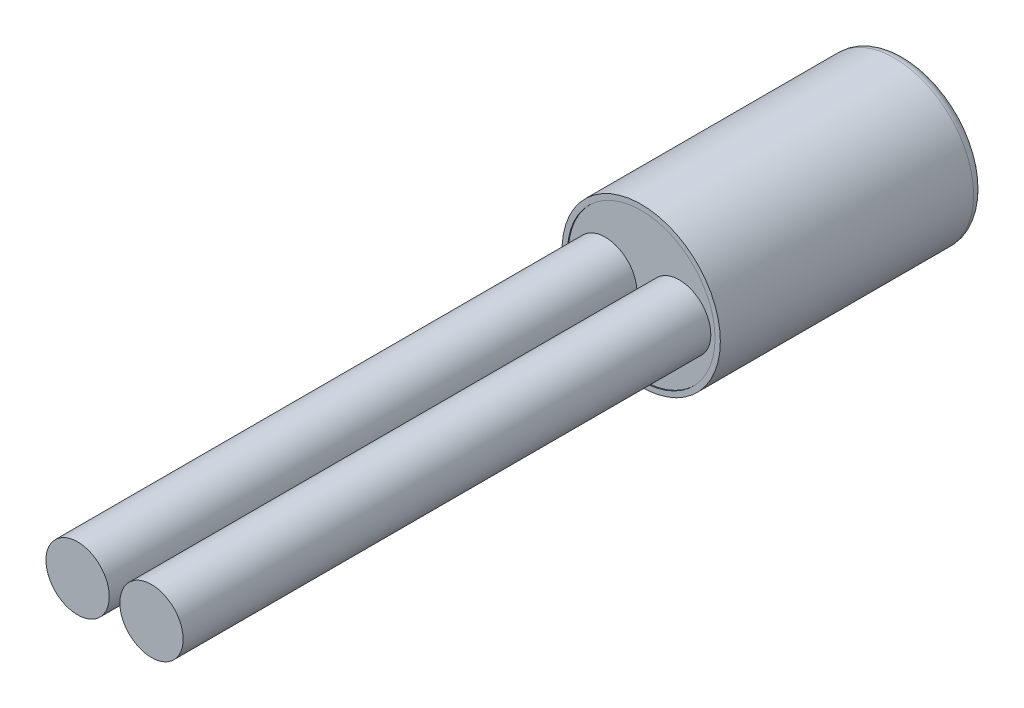
ISO-10303-21;
HEADER;
FILE_DESCRIPTION(('STEP AP214'),'2;1');
FILE_NAME('part.step','',(''),(''),'','','');
FILE_SCHEMA(('AUTOMOTIVE_DESIGN { 1 0 10303 214 1 1 1 1 }'));
ENDSEC;
DATA;
#1=APPLICATION_CONTEXT('core data for automotive mechanical design processes');
#2=APPLICATION_PROTOCOL_DEFINITION('international standard','automotive_design',2000,#1);
#3=PRODUCT_CONTEXT('',#1,'mechanical');
#4=PRODUCT('Part','Part','',(#3));
#5=PRODUCT_RELATED_PRODUCT_CATEGORY('part','',(#4));
#6=PRODUCT_DEFINITION_FORMATION('','',#4);
#7=PRODUCT_DEFINITION_CONTEXT('part definition',#1,'design');
#8=PRODUCT_DEFINITION('design','',#6,#7);
#9=PRODUCT_DEFINITION_SHAPE('','',#8);
#10=(LENGTH_UNIT() NAMED_UNIT(*) SI_UNIT(.MILLI.,.METRE.));
#11=(NAMED_UNIT(*) PLANE_ANGLE_UNIT() SI_UNIT($,.RADIAN.));
#12=(NAMED_UNIT(*) SI_UNIT($,.STERADIAN.) SOLID_ANGLE_UNIT());
#13=UNCERTAINTY_MEASURE_WITH_UNIT(LENGTH_MEASURE(1.E-05),#10,'distance_accuracy_value','');
#14=(GEOMETRIC_REPRESENTATION_CONTEXT(3) GLOBAL_UNCERTAINTY_ASSIGNED_CONTEXT((#13)) GLOBAL_UNIT_ASSIGNED_CONTEXT((#10,
#11,#12)) REPRESENTATION_CONTEXT('',''));
#15=CARTESIAN_POINT('',(0.,0.,0.));
#16=DIRECTION('',(0.,0.,1.));
#17=DIRECTION('',(1.,0.,0.));
#18=AXIS2_PLACEMENT_3D('',#15,#16,#17);
#19=CARTESIAN_POINT('',(0.,0.,5.));
#20=DIRECTION('',(0.,0.,-1.));
#21=DIRECTION('',(-1.,0.,0.));
#22=AXIS2_PLACEMENT_3D('',#19,#20,#21);
#23=CYLINDRICAL_SURFACE('',#22,1.5);
#24=CARTESIAN_POINT('',(0.,0.,0.2));
#25=DIRECTION('',(0.,0.,1.));
#26=DIRECTION('',(1.,0.,0.));
#27=AXIS2_PLACEMENT_3D('',#24,#25,#26);
#28=CIRCLE('',#27,1.5);
#29=CARTESIAN_POINT('',(1.5,0.,0.2));
#30=VERTEX_POINT('',#29);
#31=EDGE_CURVE('E51',#30,#30,#28,.T.);
#32=ORIENTED_EDGE('',*,*,#31,.T.);
#33=EDGE_LOOP('',(#32));
#34=FACE_BOUND('',#33,.T.);
#35=CARTESIAN_POINT('',(0.,0.,5.));
#36=DIRECTION('',(0.,0.,1.));
#37=DIRECTION('',(1.,0.,0.));
#38=AXIS2_PLACEMENT_3D('',#35,#36,#37);
#39=CIRCLE('',#38,1.5);
#40=CARTESIAN_POINT('',(1.5,0.,5.));
#41=VERTEX_POINT('',#40);
#42=EDGE_CURVE('E56',#41,#41,#39,.T.);
#43=ORIENTED_EDGE('',*,*,#42,.F.);
#44=EDGE_LOOP('',(#43));
#45=FACE_BOUND('',#44,.T.);
#46=ADVANCED_FACE('F43',(#34,#45),#23,.T.);
#47=CARTESIAN_POINT('',(0.,0.,5.));
#48=DIRECTION('',(0.,0.,1.));
#49=DIRECTION('',(1.,0.,0.));
#50=AXIS2_PLACEMENT_3D('',#47,#48,#49);
#51=PLANE('',#50);
#52=CARTESIAN_POINT('',(0.,0.,5.));
#53=DIRECTION('',(0.,0.,1.));
#54=DIRECTION('',(1.,0.,0.));
#55=AXIS2_PLACEMENT_3D('',#52,#53,#54);
#56=CIRCLE('',#55,1.4);
#57=CARTESIAN_POINT('',(1.4,0.,5.));
#58=VERTEX_POINT('',#57);
#59=EDGE_CURVE('E64',#58,#58,#56,.T.);
#60=ORIENTED_EDGE('',*,*,#59,.F.);
#61=EDGE_LOOP('',(#60));
#62=FACE_BOUND('',#61,.T.);
#63=ORIENTED_EDGE('',*,*,#42,.T.);
#64=EDGE_LOOP('',(#63));
#65=FACE_BOUND('',#64,.T.);
#66=ADVANCED_FACE('F105',(#62,#65),#51,.T.);
#67=CARTESIAN_POINT('',(0.,0.,0.));
#68=DIRECTION('',(0.,0.,1.));
#69=DIRECTION('',(1.,0.,0.));
#70=AXIS2_PLACEMENT_3D('',#67,#68,#69);
#71=PLANE('',#70);
#72=CARTESIAN_POINT('',(0.,0.,0.));
#73=DIRECTION('',(0.,0.,1.));
#74=DIRECTION('',(1.,0.,0.));
#75=AXIS2_PLACEMENT_3D('',#72,#73,#74);
#76=CIRCLE('',#75,1.3);
#77=CARTESIAN_POINT('',(1.3,0.,0.));
#78=VERTEX_POINT('',#77);
#79=EDGE_CURVE('E10',#78,#78,#76,.F.);
#80=ORIENTED_EDGE('',*,*,#79,.T.);
#81=EDGE_LOOP('',(#80));
#82=FACE_BOUND('',#81,.T.);
#83=ADVANCED_FACE('F108',(#82),#71,.F.);
#84=CARTESIAN_POINT('',(0.,0.,0.2));
#85=DIRECTION('',(0.,0.,1.));
#86=DIRECTION('',(1.,0.,0.));
#87=AXIS2_PLACEMENT_3D('',#84,#85,#86);
#88=TOROIDAL_SURFACE('',#87,1.3,0.2);
#89=ORIENTED_EDGE('',*,*,#79,.F.);
#90=EDGE_LOOP('',(#89));
#91=FACE_BOUND('',#90,.T.);
#92=ORIENTED_EDGE('',*,*,#31,.F.);
#93=EDGE_LOOP('',(#92));
#94=FACE_BOUND('',#93,.T.);
#95=ADVANCED_FACE('F45',(#91,#94),#88,.T.);
#96=CARTESIAN_POINT('',(0.,0.,4.98));
#97=DIRECTION('',(0.,0.,1.));
#98=DIRECTION('',(1.,0.,0.));
#99=AXIS2_PLACEMENT_3D('',#96,#97,#98);
#100=CYLINDRICAL_SURFACE('',#99,1.4);
#101=CARTESIAN_POINT('',(0.,0.,4.98));
#102=DIRECTION('',(0.,0.,1.));
#103=DIRECTION('',(1.,0.,0.));
#104=AXIS2_PLACEMENT_3D('',#101,#102,#103);
#105=CIRCLE('',#104,1.4);
#106=CARTESIAN_POINT('',(1.4,0.,4.98));
#107=VERTEX_POINT('',#106);
#108=EDGE_CURVE('E61',#107,#107,#105,.T.);
#109=ORIENTED_EDGE('',*,*,#108,.F.);
#110=EDGE_LOOP('',(#109));
#111=FACE_BOUND('',#110,.T.);
#112=ORIENTED_EDGE('',*,*,#59,.T.);
#113=EDGE_LOOP('',(#112));
#114=FACE_BOUND('',#113,.T.);
#115=ADVANCED_FACE('F94',(#111,#114),#100,.F.);
#116=CARTESIAN_POINT('',(0.,0.,4.98));
#117=DIRECTION('',(0.,0.,1.));
#118=DIRECTION('',(1.,0.,0.));
#119=AXIS2_PLACEMENT_3D('',#116,#117,#118);
#120=PLANE('',#119);
#121=CARTESIAN_POINT('',(0.7,0.,4.98));
#122=DIRECTION('',(0.,0.,1.));
#123=DIRECTION('',(1.,0.,0.));
#124=AXIS2_PLACEMENT_3D('',#121,#122,#123);
#125=CIRCLE('',#124,0.6);
#126=CARTESIAN_POINT('',(1.3,0.,4.98));
#127=VERTEX_POINT('',#126);
#128=EDGE_CURVE('E76',#127,#127,#125,.T.);
#129=ORIENTED_EDGE('',*,*,#128,.F.);
#130=EDGE_LOOP('',(#129));
#131=FACE_BOUND('',#130,.T.);
#132=CARTESIAN_POINT('',(-0.7,0.,4.98));
#133=DIRECTION('',(0.,0.,1.));
#134=DIRECTION('',(1.,0.,0.));
#135=AXIS2_PLACEMENT_3D('',#132,#133,#134);
#136=CIRCLE('',#135,0.6);
#137=CARTESIAN_POINT('',(-0.1,0.,4.98));
#138=VERTEX_POINT('',#137);
#139=EDGE_CURVE('E72',#138,#138,#136,.T.);
#140=ORIENTED_EDGE('',*,*,#139,.F.);
#141=EDGE_LOOP('',(#140));
#142=FACE_BOUND('',#141,.T.);
#143=ORIENTED_EDGE('',*,*,#108,.T.);
#144=EDGE_LOOP('',(#143));
#145=FACE_BOUND('',#144,.T.);
#146=ADVANCED_FACE('F90',(#131,#142,#145),#120,.T.);
#147=CARTESIAN_POINT('',(-0.7,0.,14.98));
#148=DIRECTION('',(0.,0.,-1.));
#149=DIRECTION('',(-1.,0.,0.));
#150=AXIS2_PLACEMENT_3D('',#147,#148,#149);
#151=CYLINDRICAL_SURFACE('',#150,0.6);
#152=CARTESIAN_POINT('',(-0.7,0.,14.98));
#153=DIRECTION('',(0.,0.,1.));
#154=DIRECTION('',(1.,0.,0.));
#155=AXIS2_PLACEMENT_3D('',#152,#153,#154);
#156=CIRCLE('',#155,0.6);
#157=CARTESIAN_POINT('',(-0.1,0.,14.98));
#158=VERTEX_POINT('',#157);
#159=EDGE_CURVE('E68',#158,#158,#156,.T.);
#160=ORIENTED_EDGE('',*,*,#159,.F.);
#161=EDGE_LOOP('',(#160));
#162=FACE_BOUND('',#161,.T.);
#163=ORIENTED_EDGE('',*,*,#139,.T.);
#164=EDGE_LOOP('',(#163));
#165=FACE_BOUND('',#164,.T.);
#166=ADVANCED_FACE('F93',(#162,#165),#151,.T.);
#167=CARTESIAN_POINT('',(-0.7,0.,14.98));
#168=DIRECTION('',(0.,0.,1.));
#169=DIRECTION('',(1.,0.,0.));
#170=AXIS2_PLACEMENT_3D('',#167,#168,#169);
#171=PLANE('',#170);
#172=ORIENTED_EDGE('',*,*,#159,.T.);
#173=EDGE_LOOP('',(#172));
#174=FACE_BOUND('',#173,.T.);
#175=ADVANCED_FACE('F120',(#174),#171,.T.);
#176=CARTESIAN_POINT('',(0.7,0.,14.98));
#177=DIRECTION('',(0.,0.,-1.));
#178=DIRECTION('',(-1.,0.,0.));
#179=AXIS2_PLACEMENT_3D('',#176,#177,#178);
#180=CYLINDRICAL_SURFACE('',#179,0.6);
#181=CARTESIAN_POINT('',(0.7,0.,14.98));
#182=DIRECTION('',(0.,0.,1.));
#183=DIRECTION('',(1.,0.,0.));
#184=AXIS2_PLACEMENT_3D('',#181,#182,#183);
#185=CIRCLE('',#184,0.6);
#186=CARTESIAN_POINT('',(1.3,0.,14.98));
#187=VERTEX_POINT('',#186);
#188=EDGE_CURVE('E80',#187,#187,#185,.T.);
#189=ORIENTED_EDGE('',*,*,#188,.F.);
#190=EDGE_LOOP('',(#189));
#191=FACE_BOUND('',#190,.T.);
#192=ORIENTED_EDGE('',*,*,#128,.T.);
#193=EDGE_LOOP('',(#192));
#194=FACE_BOUND('',#193,.T.);
#195=ADVANCED_FACE('F88',(#191,#194),#180,.T.);
#196=CARTESIAN_POINT('',(0.7,0.,14.98));
#197=DIRECTION('',(0.,0.,1.));
#198=DIRECTION('',(1.,0.,0.));
#199=AXIS2_PLACEMENT_3D('',#196,#197,#198);
#200=PLANE('',#199);
#201=ORIENTED_EDGE('',*,*,#188,.T.);
#202=EDGE_LOOP('',(#201));
#203=FACE_BOUND('',#202,.T.);
#204=ADVANCED_FACE('F125',(#203),#200,.T.);
#205=CLOSED_SHELL('',(#46,#66,#83,#95,#115,#146,#166,#175,#195,#204));
#206=MANIFOLD_SOLID_BREP('B2',#205);
#207=ADVANCED_BREP_SHAPE_REPRESENTATION('',(#18,#206),#14);
#208=SHAPE_DEFINITION_REPRESENTATION(#9,#207);
ENDSEC;
END-ISO-10303-21;
